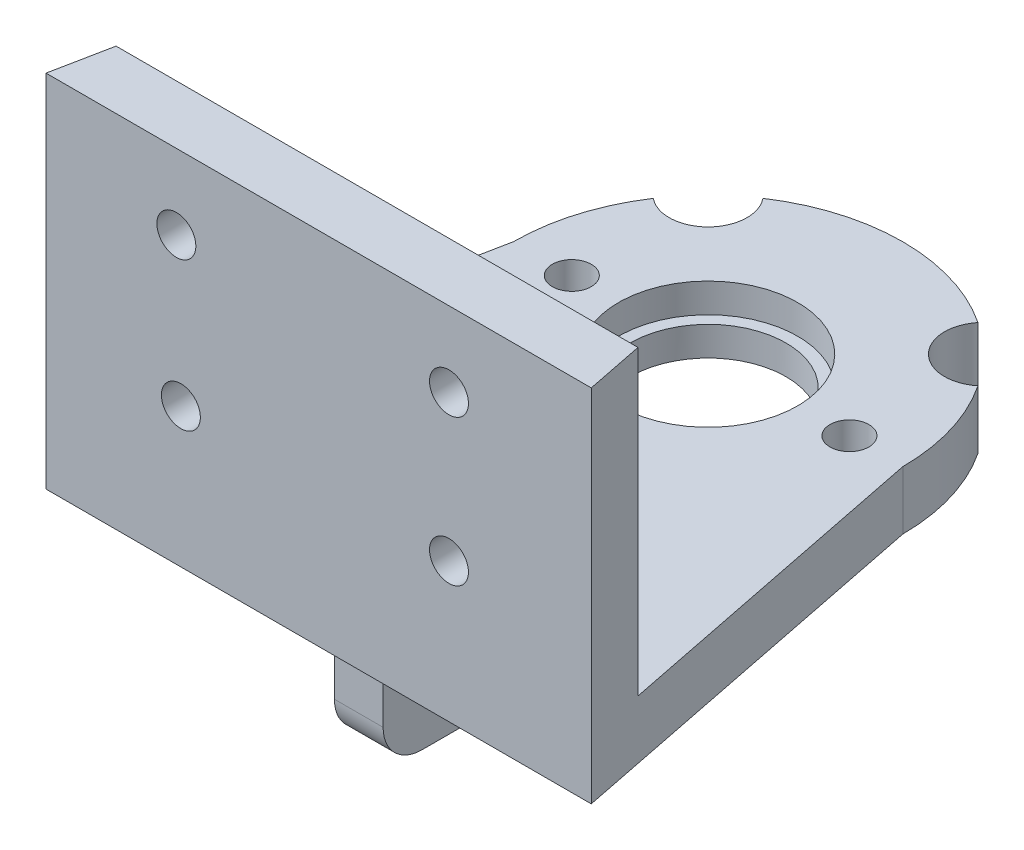
ISO-10303-21;
HEADER;
FILE_DESCRIPTION(('STEP AP214'),'2;1');
FILE_NAME('part.step','',(''),(''),'','','');
FILE_SCHEMA(('AUTOMOTIVE_DESIGN { 1 0 10303 214 1 1 1 1 }'));
ENDSEC;
DATA;
#1=APPLICATION_CONTEXT('core data for automotive mechanical design processes');
#2=APPLICATION_PROTOCOL_DEFINITION('international standard','automotive_design',2000,#1);
#3=PRODUCT_CONTEXT('',#1,'mechanical');
#4=PRODUCT('Part','Part','',(#3));
#5=PRODUCT_RELATED_PRODUCT_CATEGORY('part','',(#4));
#6=PRODUCT_DEFINITION_FORMATION('','',#4);
#7=PRODUCT_DEFINITION_CONTEXT('part definition',#1,'design');
#8=PRODUCT_DEFINITION('design','',#6,#7);
#9=PRODUCT_DEFINITION_SHAPE('','',#8);
#10=(LENGTH_UNIT() NAMED_UNIT(*) SI_UNIT(.MILLI.,.METRE.));
#11=(NAMED_UNIT(*) PLANE_ANGLE_UNIT() SI_UNIT($,.RADIAN.));
#12=(NAMED_UNIT(*) SI_UNIT($,.STERADIAN.) SOLID_ANGLE_UNIT());
#13=UNCERTAINTY_MEASURE_WITH_UNIT(LENGTH_MEASURE(1.E-05),#10,'distance_accuracy_value','');
#14=(GEOMETRIC_REPRESENTATION_CONTEXT(3) GLOBAL_UNCERTAINTY_ASSIGNED_CONTEXT((#13)) GLOBAL_UNIT_ASSIGNED_CONTEXT((#10,
#11,#12)) REPRESENTATION_CONTEXT('',''));
#15=CARTESIAN_POINT('',(0.,0.,0.));
#16=DIRECTION('',(0.,0.,1.));
#17=DIRECTION('',(1.,0.,0.));
#18=AXIS2_PLACEMENT_3D('',#15,#16,#17);
#19=CARTESIAN_POINT('',(0.,0.,0.));
#20=DIRECTION('',(0.,-1.,0.));
#21=DIRECTION('',(0.,0.,-1.));
#22=AXIS2_PLACEMENT_3D('',#19,#20,#21);
#23=PLANE('',#22);
#24=CARTESIAN_POINT('',(7.25622478910171,0.,0.));
#25=DIRECTION('',(0.,1.,0.));
#26=DIRECTION('',(0.,0.,1.));
#27=AXIS2_PLACEMENT_3D('',#24,#25,#26);
#28=CIRCLE('',#27,1.);
#29=CARTESIAN_POINT('',(7.25622478910171,0.,1.));
#30=VERTEX_POINT('',#29);
#31=EDGE_CURVE('E299',#30,#30,#28,.T.);
#32=ORIENTED_EDGE('',*,*,#31,.T.);
#33=EDGE_LOOP('',(#32));
#34=FACE_BOUND('',#33,.T.);
#35=CARTESIAN_POINT('',(0.,0.,7.59794095686522));
#36=DIRECTION('',(0.,1.,0.));
#37=DIRECTION('',(0.,0.,1.));
#38=AXIS2_PLACEMENT_3D('',#35,#36,#37);
#39=CIRCLE('',#38,1.);
#40=CARTESIAN_POINT('',(0.,0.,8.59794095686522));
#41=VERTEX_POINT('',#40);
#42=EDGE_CURVE('E305',#41,#41,#39,.T.);
#43=ORIENTED_EDGE('',*,*,#42,.T.);
#44=EDGE_LOOP('',(#43));
#45=FACE_BOUND('',#44,.T.);
#46=CARTESIAN_POINT('',(-7.,0.,0.));
#47=DIRECTION('',(0.,1.,0.));
#48=DIRECTION('',(0.,0.,1.));
#49=AXIS2_PLACEMENT_3D('',#46,#47,#48);
#50=CIRCLE('',#49,1.);
#51=CARTESIAN_POINT('',(-7.,0.,0.999999999999975));
#52=VERTEX_POINT('',#51);
#53=EDGE_CURVE('E311',#52,#52,#50,.T.);
#54=ORIENTED_EDGE('',*,*,#53,.T.);
#55=EDGE_LOOP('',(#54));
#56=FACE_BOUND('',#55,.T.);
#57=CARTESIAN_POINT('',(7.07106781186546,0.,-7.07106781186549));
#58=DIRECTION('',(0.,-1.,0.));
#59=DIRECTION('',(0.,0.,-1.));
#60=AXIS2_PLACEMENT_3D('',#57,#58,#59);
#61=CIRCLE('',#60,2.);
#62=CARTESIAN_POINT('',(8.33677118357518,0.,-5.52252172768116));
#63=VERTEX_POINT('',#62);
#64=CARTESIAN_POINT('',(5.52252172768113,0.,-8.3367711835752));
#65=VERTEX_POINT('',#64);
#66=EDGE_CURVE('E169',#63,#65,#61,.T.);
#67=ORIENTED_EDGE('',*,*,#66,.F.);
#68=CARTESIAN_POINT('',(0.,0.,0.));
#69=DIRECTION('',(0.,1.,0.));
#70=DIRECTION('',(0.,0.,-1.));
#71=AXIS2_PLACEMENT_3D('',#68,#69,#70);
#72=CIRCLE('',#71,10.);
#73=CARTESIAN_POINT('',(10.,0.,0.));
#74=VERTEX_POINT('',#73);
#75=EDGE_CURVE('E399',#74,#63,#72,.T.);
#76=ORIENTED_EDGE('',*,*,#75,.F.);
#77=DIRECTION('',(-0.196116135138184,0.,-0.98058067569092));
#78=VECTOR('',#77,1.);
#79=CARTESIAN_POINT('',(10.,0.,0.));
#80=LINE('',#79,#78);
#81=CARTESIAN_POINT('',(14.,0.,20.));
#82=VERTEX_POINT('',#81);
#83=EDGE_CURVE('E192',#82,#74,#80,.T.);
#84=ORIENTED_EDGE('',*,*,#83,.F.);
#85=DIRECTION('',(1.,0.,0.));
#86=VECTOR('',#85,1.);
#87=CARTESIAN_POINT('',(-14.,0.,20.));
#88=LINE('',#87,#86);
#89=CARTESIAN_POINT('',(-14.,0.,20.));
#90=VERTEX_POINT('',#89);
#91=EDGE_CURVE('E397',#90,#82,#88,.T.);
#92=ORIENTED_EDGE('',*,*,#91,.F.);
#93=DIRECTION('',(-0.196116135138184,0.,0.98058067569092));
#94=VECTOR('',#93,1.);
#95=CARTESIAN_POINT('',(-10.,0.,0.));
#96=LINE('',#95,#94);
#97=CARTESIAN_POINT('',(-10.,0.,0.));
#98=VERTEX_POINT('',#97);
#99=EDGE_CURVE('E374',#98,#90,#96,.T.);
#100=ORIENTED_EDGE('',*,*,#99,.F.);
#101=CARTESIAN_POINT('',(-8.33677118357518,0.,-5.52252172768116));
#102=VERTEX_POINT('',#101);
#103=EDGE_CURVE('E392',#102,#98,#72,.T.);
#104=ORIENTED_EDGE('',*,*,#103,.F.);
#105=CARTESIAN_POINT('',(-7.07106781186546,0.,-7.07106781186549));
#106=DIRECTION('',(0.,-1.,0.));
#107=DIRECTION('',(0.,0.,-1.));
#108=AXIS2_PLACEMENT_3D('',#105,#106,#107);
#109=CIRCLE('',#108,2.);
#110=CARTESIAN_POINT('',(-5.52252172768113,0.,-8.3367711835752));
#111=VERTEX_POINT('',#110);
#112=EDGE_CURVE('E228',#111,#102,#109,.T.);
#113=ORIENTED_EDGE('',*,*,#112,.F.);
#114=EDGE_CURVE('E401',#65,#111,#72,.T.);
#115=ORIENTED_EDGE('',*,*,#114,.F.);
#116=EDGE_LOOP('',(#67,#76,#84,#92,#100,#104,#113,#115));
#117=FACE_BOUND('',#116,.T.);
#118=CARTESIAN_POINT('',(0.,0.,0.));
#119=DIRECTION('',(0.,-1.,0.));
#120=DIRECTION('',(0.,0.,-1.));
#121=AXIS2_PLACEMENT_3D('',#118,#119,#120);
#122=CIRCLE('',#121,4.);
#123=CARTESIAN_POINT('',(0.,0.,-4.));
#124=VERTEX_POINT('',#123);
#125=EDGE_CURVE('E205',#124,#124,#122,.T.);
#126=ORIENTED_EDGE('',*,*,#125,.F.);
#127=EDGE_LOOP('',(#126));
#128=FACE_BOUND('',#127,.T.);
#129=DIRECTION('',(0.,0.,1.));
#130=VECTOR('',#129,1.);
#131=CARTESIAN_POINT('',(-1.25,0.,10.9392819052399));
#132=LINE('',#131,#130);
#133=CARTESIAN_POINT('',(-1.25,0.,8.93928190523991));
#134=VERTEX_POINT('',#133);
#135=CARTESIAN_POINT('',(-1.25,0.,19.9392819052399));
#136=VERTEX_POINT('',#135);
#137=EDGE_CURVE('E266',#134,#136,#132,.T.);
#138=ORIENTED_EDGE('',*,*,#137,.T.);
#139=DIRECTION('',(-1.,0.,0.));
#140=VECTOR('',#139,1.);
#141=CARTESIAN_POINT('',(0.,0.,19.9392819052399));
#142=LINE('',#141,#140);
#143=CARTESIAN_POINT('',(1.25,0.,19.9392819052399));
#144=VERTEX_POINT('',#143);
#145=EDGE_CURVE('E240',#136,#144,#142,.F.);
#146=ORIENTED_EDGE('',*,*,#145,.T.);
#147=DIRECTION('',(0.,0.,1.));
#148=VECTOR('',#147,1.);
#149=CARTESIAN_POINT('',(1.25,0.,10.9392819052399));
#150=LINE('',#149,#148);
#151=CARTESIAN_POINT('',(1.25,0.,8.93928190523991));
#152=VERTEX_POINT('',#151);
#153=EDGE_CURVE('E283',#152,#144,#150,.T.);
#154=ORIENTED_EDGE('',*,*,#153,.F.);
#155=DIRECTION('',(-1.,0.,0.));
#156=VECTOR('',#155,1.);
#157=CARTESIAN_POINT('',(-1.25,0.,8.93928190523991));
#158=LINE('',#157,#156);
#159=EDGE_CURVE('E237',#152,#134,#158,.T.);
#160=ORIENTED_EDGE('',*,*,#159,.T.);
#161=EDGE_LOOP('',(#138,#146,#154,#160));
#162=FACE_BOUND('',#161,.T.);
#163=ADVANCED_FACE('F37',(#34,#45,#56,#117,#128,#162),#23,.T.);
#164=CARTESIAN_POINT('',(0.,3.,0.));
#165=DIRECTION('',(0.,-1.,0.));
#166=DIRECTION('',(0.,0.,-1.));
#167=AXIS2_PLACEMENT_3D('',#164,#165,#166);
#168=CYLINDRICAL_SURFACE('',#167,10.);
#169=ORIENTED_EDGE('',*,*,#75,.T.);
#170=DIRECTION('',(0.,1.,0.));
#171=VECTOR('',#170,1.);
#172=CARTESIAN_POINT('',(8.33677118357519,-2.,-5.52252172768115));
#173=LINE('',#172,#171);
#174=CARTESIAN_POINT('',(8.33677118357519,3.,-5.52252172768115));
#175=VERTEX_POINT('',#174);
#176=EDGE_CURVE('E173',#63,#175,#173,.T.);
#177=ORIENTED_EDGE('',*,*,#176,.T.);
#178=CARTESIAN_POINT('',(0.,3.,0.));
#179=DIRECTION('',(0.,1.,0.));
#180=DIRECTION('',(0.,0.,-1.));
#181=AXIS2_PLACEMENT_3D('',#178,#179,#180);
#182=CIRCLE('',#181,10.);
#183=CARTESIAN_POINT('',(10.,3.,0.));
#184=VERTEX_POINT('',#183);
#185=EDGE_CURVE('E182',#184,#175,#182,.T.);
#186=ORIENTED_EDGE('',*,*,#185,.F.);
#187=DIRECTION('',(0.,-1.,0.));
#188=VECTOR('',#187,1.);
#189=CARTESIAN_POINT('',(10.,3.,0.));
#190=LINE('',#189,#188);
#191=EDGE_CURVE('E208',#184,#74,#190,.T.);
#192=ORIENTED_EDGE('',*,*,#191,.T.);
#193=EDGE_LOOP('',(#169,#177,#186,#192));
#194=FACE_BOUND('',#193,.T.);
#195=ADVANCED_FACE('F412',(#194),#168,.T.);
#196=CARTESIAN_POINT('',(5.52252172768112,3.,-8.33677118357521));
#197=VERTEX_POINT('',#196);
#198=CARTESIAN_POINT('',(-5.52252172768112,3.,-8.33677118357521));
#199=VERTEX_POINT('',#198);
#200=EDGE_CURVE('E179',#197,#199,#182,.T.);
#201=ORIENTED_EDGE('',*,*,#200,.F.);
#202=DIRECTION('',(0.,1.,0.));
#203=VECTOR('',#202,1.);
#204=CARTESIAN_POINT('',(5.52252172768112,-2.,-8.33677118357521));
#205=LINE('',#204,#203);
#206=EDGE_CURVE('E163',#197,#65,#205,.F.);
#207=ORIENTED_EDGE('',*,*,#206,.T.);
#208=ORIENTED_EDGE('',*,*,#114,.T.);
#209=DIRECTION('',(0.,1.,0.));
#210=VECTOR('',#209,1.);
#211=CARTESIAN_POINT('',(-5.52252172768112,-2.,-8.33677118357521));
#212=LINE('',#211,#210);
#213=EDGE_CURVE('E188',#111,#199,#212,.T.);
#214=ORIENTED_EDGE('',*,*,#213,.T.);
#215=EDGE_LOOP('',(#201,#207,#208,#214));
#216=FACE_BOUND('',#215,.T.);
#217=ADVANCED_FACE('F186',(#216),#168,.T.);
#218=CARTESIAN_POINT('',(0.,-10.,0.));
#219=DIRECTION('',(0.,1.,0.));
#220=DIRECTION('',(0.,0.,1.));
#221=AXIS2_PLACEMENT_3D('',#218,#219,#220);
#222=CYLINDRICAL_SURFACE('',#221,4.);
#223=ORIENTED_EDGE('',*,*,#125,.T.);
#224=EDGE_LOOP('',(#223));
#225=FACE_BOUND('',#224,.T.);
#226=CARTESIAN_POINT('',(0.,1.5,0.));
#227=DIRECTION('',(0.,1.,0.));
#228=DIRECTION('',(0.,0.,1.));
#229=AXIS2_PLACEMENT_3D('',#226,#227,#228);
#230=CIRCLE('',#229,4.);
#231=CARTESIAN_POINT('',(0.,1.5,4.));
#232=VERTEX_POINT('',#231);
#233=EDGE_CURVE('E213',#232,#232,#230,.F.);
#234=ORIENTED_EDGE('',*,*,#233,.F.);
#235=EDGE_LOOP('',(#234));
#236=FACE_BOUND('',#235,.T.);
#237=ADVANCED_FACE('F407',(#225,#236),#222,.F.);
#238=CARTESIAN_POINT('',(0.,3.,0.));
#239=DIRECTION('',(0.,-1.,0.));
#240=DIRECTION('',(0.,0.,-1.));
#241=AXIS2_PLACEMENT_3D('',#238,#239,#240);
#242=PLANE('',#241);
#243=CARTESIAN_POINT('',(7.25622478910171,3.,0.));
#244=DIRECTION('',(0.,1.,0.));
#245=DIRECTION('',(0.,0.,1.));
#246=AXIS2_PLACEMENT_3D('',#243,#244,#245);
#247=CIRCLE('',#246,1.);
#248=CARTESIAN_POINT('',(7.25622478910171,3.,1.));
#249=VERTEX_POINT('',#248);
#250=EDGE_CURVE('E298',#249,#249,#247,.T.);
#251=ORIENTED_EDGE('',*,*,#250,.F.);
#252=EDGE_LOOP('',(#251));
#253=FACE_BOUND('',#252,.T.);
#254=CARTESIAN_POINT('',(0.,3.,7.59794095686522));
#255=DIRECTION('',(0.,1.,0.));
#256=DIRECTION('',(0.,0.,1.));
#257=AXIS2_PLACEMENT_3D('',#254,#255,#256);
#258=CIRCLE('',#257,1.);
#259=CARTESIAN_POINT('',(0.,3.,8.59794095686522));
#260=VERTEX_POINT('',#259);
#261=EDGE_CURVE('E302',#260,#260,#258,.T.);
#262=ORIENTED_EDGE('',*,*,#261,.F.);
#263=EDGE_LOOP('',(#262));
#264=FACE_BOUND('',#263,.T.);
#265=CARTESIAN_POINT('',(-7.,3.,0.));
#266=DIRECTION('',(0.,1.,0.));
#267=DIRECTION('',(0.,0.,1.));
#268=AXIS2_PLACEMENT_3D('',#265,#266,#267);
#269=CIRCLE('',#268,1.);
#270=CARTESIAN_POINT('',(-7.,3.,0.999999999999975));
#271=VERTEX_POINT('',#270);
#272=EDGE_CURVE('E308',#271,#271,#269,.T.);
#273=ORIENTED_EDGE('',*,*,#272,.F.);
#274=EDGE_LOOP('',(#273));
#275=FACE_BOUND('',#274,.T.);
#276=CARTESIAN_POINT('',(0.,3.,0.));
#277=DIRECTION('',(0.,1.,0.));
#278=DIRECTION('',(0.,0.,1.));
#279=AXIS2_PLACEMENT_3D('',#276,#277,#278);
#280=CIRCLE('',#279,4.6);
#281=CARTESIAN_POINT('',(0.,3.,4.6));
#282=VERTEX_POINT('',#281);
#283=EDGE_CURVE('E346',#282,#282,#280,.T.);
#284=ORIENTED_EDGE('',*,*,#283,.F.);
#285=EDGE_LOOP('',(#284));
#286=FACE_BOUND('',#285,.T.);
#287=ORIENTED_EDGE('',*,*,#185,.T.);
#288=CARTESIAN_POINT('',(7.07106781186546,3.,-7.07106781186549));
#289=DIRECTION('',(0.,1.,0.));
#290=DIRECTION('',(0.,0.,-1.));
#291=AXIS2_PLACEMENT_3D('',#288,#289,#290);
#292=CIRCLE('',#291,2.);
#293=EDGE_CURVE('E166',#197,#175,#292,.T.);
#294=ORIENTED_EDGE('',*,*,#293,.F.);
#295=ORIENTED_EDGE('',*,*,#200,.T.);
#296=CARTESIAN_POINT('',(-7.07106781186546,3.,-7.07106781186549));
#297=DIRECTION('',(0.,1.,0.));
#298=DIRECTION('',(0.,0.,1.));
#299=AXIS2_PLACEMENT_3D('',#296,#297,#298);
#300=CIRCLE('',#299,2.);
#301=CARTESIAN_POINT('',(-8.33677118357519,3.,-5.52252172768115));
#302=VERTEX_POINT('',#301);
#303=EDGE_CURVE('E340',#302,#199,#300,.T.);
#304=ORIENTED_EDGE('',*,*,#303,.F.);
#305=CARTESIAN_POINT('',(-10.,3.,0.));
#306=VERTEX_POINT('',#305);
#307=EDGE_CURVE('E189',#302,#306,#182,.T.);
#308=ORIENTED_EDGE('',*,*,#307,.T.);
#309=DIRECTION('',(-0.196116135138184,0.,0.98058067569092));
#310=VECTOR('',#309,1.);
#311=CARTESIAN_POINT('',(-10.,3.,0.));
#312=LINE('',#311,#310);
#313=CARTESIAN_POINT('',(-13.4,3.,17.));
#314=VERTEX_POINT('',#313);
#315=EDGE_CURVE('E191',#306,#314,#312,.T.);
#316=ORIENTED_EDGE('',*,*,#315,.T.);
#317=DIRECTION('',(-1.,0.,0.));
#318=VECTOR('',#317,1.);
#319=CARTESIAN_POINT('',(-13.4,3.,17.));
#320=LINE('',#319,#318);
#321=CARTESIAN_POINT('',(13.4,3.,17.));
#322=VERTEX_POINT('',#321);
#323=EDGE_CURVE('E209',#322,#314,#320,.T.);
#324=ORIENTED_EDGE('',*,*,#323,.F.);
#325=DIRECTION('',(-0.196116135138184,0.,-0.98058067569092));
#326=VECTOR('',#325,1.);
#327=CARTESIAN_POINT('',(10.,3.,0.));
#328=LINE('',#327,#326);
#329=EDGE_CURVE('E204',#322,#184,#328,.T.);
#330=ORIENTED_EDGE('',*,*,#329,.T.);
#331=EDGE_LOOP('',(#287,#294,#295,#304,#308,#316,#324,#330));
#332=FACE_BOUND('',#331,.T.);
#333=ADVANCED_FACE('F177',(#253,#264,#275,#286,#332),#242,.F.);
#334=ORIENTED_EDGE('',*,*,#307,.F.);
#335=DIRECTION('',(0.,1.,0.));
#336=VECTOR('',#335,1.);
#337=CARTESIAN_POINT('',(-8.33677118357519,-2.,-5.52252172768115));
#338=LINE('',#337,#336);
#339=EDGE_CURVE('E342',#302,#102,#338,.F.);
#340=ORIENTED_EDGE('',*,*,#339,.T.);
#341=ORIENTED_EDGE('',*,*,#103,.T.);
#342=DIRECTION('',(0.,-1.,0.));
#343=VECTOR('',#342,1.);
#344=CARTESIAN_POINT('',(-10.,3.,0.));
#345=LINE('',#344,#343);
#346=EDGE_CURVE('E230',#306,#98,#345,.T.);
#347=ORIENTED_EDGE('',*,*,#346,.F.);
#348=EDGE_LOOP('',(#334,#340,#341,#347));
#349=FACE_BOUND('',#348,.T.);
#350=ADVANCED_FACE('F390',(#349),#168,.T.);
#351=CARTESIAN_POINT('',(-10.,3.,0.));
#352=DIRECTION('',(0.98058067569092,0.,0.196116135138184));
#353=DIRECTION('',(0.196116135138184,0.,-0.98058067569092));
#354=AXIS2_PLACEMENT_3D('',#351,#352,#353);
#355=PLANE('',#354);
#356=ORIENTED_EDGE('',*,*,#99,.T.);
#357=DIRECTION('',(0.,-1.,0.));
#358=VECTOR('',#357,1.);
#359=CARTESIAN_POINT('',(-14.,3.,20.));
#360=LINE('',#359,#358);
#361=CARTESIAN_POINT('',(-14.,18.5,20.));
#362=VERTEX_POINT('',#361);
#363=EDGE_CURVE('E370',#362,#90,#360,.T.);
#364=ORIENTED_EDGE('',*,*,#363,.F.);
#365=DIRECTION('',(-0.196116135138184,0.,0.98058067569092));
#366=VECTOR('',#365,1.);
#367=CARTESIAN_POINT('',(-13.4,18.5,17.));
#368=LINE('',#367,#366);
#369=CARTESIAN_POINT('',(-13.4,18.5,17.));
#370=VERTEX_POINT('',#369);
#371=EDGE_CURVE('E212',#370,#362,#368,.T.);
#372=ORIENTED_EDGE('',*,*,#371,.F.);
#373=DIRECTION('',(0.,-1.,0.));
#374=VECTOR('',#373,1.);
#375=CARTESIAN_POINT('',(-13.4,18.5,17.));
#376=LINE('',#375,#374);
#377=EDGE_CURVE('E214',#370,#314,#376,.T.);
#378=ORIENTED_EDGE('',*,*,#377,.T.);
#379=ORIENTED_EDGE('',*,*,#315,.F.);
#380=ORIENTED_EDGE('',*,*,#346,.T.);
#381=EDGE_LOOP('',(#356,#364,#372,#378,#379,#380));
#382=FACE_BOUND('',#381,.T.);
#383=ADVANCED_FACE('F368',(#382),#355,.F.);
#384=CARTESIAN_POINT('',(-14.,3.,20.));
#385=DIRECTION('',(0.,0.,-1.));
#386=DIRECTION('',(-1.,0.,0.));
#387=AXIS2_PLACEMENT_3D('',#384,#385,#386);
#388=PLANE('',#387);
#389=CARTESIAN_POINT('',(-7.07366894934284,7.15183711810639,20.));
#390=DIRECTION('',(0.,0.,-1.));
#391=DIRECTION('',(-1.,0.,0.));
#392=AXIS2_PLACEMENT_3D('',#389,#390,#391);
#393=CIRCLE('',#392,1.);
#394=CARTESIAN_POINT('',(-8.07366894934284,7.15183711810639,20.));
#395=VERTEX_POINT('',#394);
#396=EDGE_CURVE('E319',#395,#395,#393,.T.);
#397=ORIENTED_EDGE('',*,*,#396,.T.);
#398=EDGE_LOOP('',(#397));
#399=FACE_BOUND('',#398,.T.);
#400=CARTESIAN_POINT('',(-7.30606136960896,14.6518371181064,20.));
#401=DIRECTION('',(0.,0.,-1.));
#402=DIRECTION('',(-1.,0.,0.));
#403=AXIS2_PLACEMENT_3D('',#400,#401,#402);
#404=CIRCLE('',#403,1.);
#405=CARTESIAN_POINT('',(-8.30606136960896,14.6518371181064,20.));
#406=VERTEX_POINT('',#405);
#407=EDGE_CURVE('E325',#406,#406,#404,.T.);
#408=ORIENTED_EDGE('',*,*,#407,.T.);
#409=EDGE_LOOP('',(#408));
#410=FACE_BOUND('',#409,.T.);
#411=CARTESIAN_POINT('',(6.69393863039105,14.6518371181064,20.));
#412=DIRECTION('',(0.,0.,-1.));
#413=DIRECTION('',(-1.,0.,0.));
#414=AXIS2_PLACEMENT_3D('',#411,#412,#413);
#415=CIRCLE('',#414,1.00000000000001);
#416=CARTESIAN_POINT('',(5.69393863039104,14.6518371181064,20.));
#417=VERTEX_POINT('',#416);
#418=EDGE_CURVE('E331',#417,#417,#415,.T.);
#419=ORIENTED_EDGE('',*,*,#418,.T.);
#420=EDGE_LOOP('',(#419));
#421=FACE_BOUND('',#420,.T.);
#422=CARTESIAN_POINT('',(6.69393863039105,7.1518371181064,20.));
#423=DIRECTION('',(0.,0.,-1.));
#424=DIRECTION('',(-1.,0.,0.));
#425=AXIS2_PLACEMENT_3D('',#422,#423,#424);
#426=CIRCLE('',#425,1.00000000000001);
#427=CARTESIAN_POINT('',(5.69393863039104,7.1518371181064,20.));
#428=VERTEX_POINT('',#427);
#429=EDGE_CURVE('E183',#428,#428,#426,.T.);
#430=ORIENTED_EDGE('',*,*,#429,.T.);
#431=EDGE_LOOP('',(#430));
#432=FACE_BOUND('',#431,.T.);
#433=ORIENTED_EDGE('',*,*,#91,.T.);
#434=DIRECTION('',(0.,-1.,0.));
#435=VECTOR('',#434,1.);
#436=CARTESIAN_POINT('',(14.,3.,20.));
#437=LINE('',#436,#435);
#438=CARTESIAN_POINT('',(14.,18.5,20.));
#439=VERTEX_POINT('',#438);
#440=EDGE_CURVE('E377',#439,#82,#437,.T.);
#441=ORIENTED_EDGE('',*,*,#440,.F.);
#442=DIRECTION('',(1.,0.,0.));
#443=VECTOR('',#442,1.);
#444=CARTESIAN_POINT('',(-14.,18.5,20.));
#445=LINE('',#444,#443);
#446=EDGE_CURVE('E353',#362,#439,#445,.T.);
#447=ORIENTED_EDGE('',*,*,#446,.F.);
#448=ORIENTED_EDGE('',*,*,#363,.T.);
#449=EDGE_LOOP('',(#433,#441,#447,#448));
#450=FACE_BOUND('',#449,.T.);
#451=ADVANCED_FACE('F379',(#399,#410,#421,#432,#450),#388,.F.);
#452=CARTESIAN_POINT('',(10.,3.,0.));
#453=DIRECTION('',(-0.98058067569092,0.,0.196116135138184));
#454=DIRECTION('',(0.196116135138184,0.,0.98058067569092));
#455=AXIS2_PLACEMENT_3D('',#452,#453,#454);
#456=PLANE('',#455);
#457=ORIENTED_EDGE('',*,*,#83,.T.);
#458=ORIENTED_EDGE('',*,*,#191,.F.);
#459=ORIENTED_EDGE('',*,*,#329,.F.);
#460=DIRECTION('',(0.,-1.,0.));
#461=VECTOR('',#460,1.);
#462=CARTESIAN_POINT('',(13.4,18.5,17.));
#463=LINE('',#462,#461);
#464=CARTESIAN_POINT('',(13.4,18.5,17.));
#465=VERTEX_POINT('',#464);
#466=EDGE_CURVE('E217',#465,#322,#463,.T.);
#467=ORIENTED_EDGE('',*,*,#466,.F.);
#468=DIRECTION('',(-0.196116135138184,0.,-0.98058067569092));
#469=VECTOR('',#468,1.);
#470=CARTESIAN_POINT('',(14.,18.5,20.));
#471=LINE('',#470,#469);
#472=EDGE_CURVE('E356',#439,#465,#471,.T.);
#473=ORIENTED_EDGE('',*,*,#472,.F.);
#474=ORIENTED_EDGE('',*,*,#440,.T.);
#475=EDGE_LOOP('',(#457,#458,#459,#467,#473,#474));
#476=FACE_BOUND('',#475,.T.);
#477=ADVANCED_FACE('F382',(#476),#456,.F.);
#478=CARTESIAN_POINT('',(-13.4,18.5,17.));
#479=DIRECTION('',(0.,0.,1.));
#480=DIRECTION('',(1.,0.,0.));
#481=AXIS2_PLACEMENT_3D('',#478,#479,#480);
#482=PLANE('',#481);
#483=CARTESIAN_POINT('',(-7.07366894934284,7.15183711810639,17.));
#484=DIRECTION('',(0.,0.,-1.));
#485=DIRECTION('',(-1.,0.,0.));
#486=AXIS2_PLACEMENT_3D('',#483,#484,#485);
#487=CIRCLE('',#486,1.);
#488=CARTESIAN_POINT('',(-8.07366894934284,7.15183711810639,17.));
#489=VERTEX_POINT('',#488);
#490=EDGE_CURVE('E314',#489,#489,#487,.T.);
#491=ORIENTED_EDGE('',*,*,#490,.F.);
#492=EDGE_LOOP('',(#491));
#493=FACE_BOUND('',#492,.T.);
#494=CARTESIAN_POINT('',(-7.30606136960896,14.6518371181064,17.));
#495=DIRECTION('',(0.,0.,-1.));
#496=DIRECTION('',(-1.,0.,0.));
#497=AXIS2_PLACEMENT_3D('',#494,#495,#496);
#498=CIRCLE('',#497,1.);
#499=CARTESIAN_POINT('',(-8.30606136960896,14.6518371181064,17.));
#500=VERTEX_POINT('',#499);
#501=EDGE_CURVE('E322',#500,#500,#498,.T.);
#502=ORIENTED_EDGE('',*,*,#501,.F.);
#503=EDGE_LOOP('',(#502));
#504=FACE_BOUND('',#503,.T.);
#505=CARTESIAN_POINT('',(6.69393863039105,14.6518371181064,17.));
#506=DIRECTION('',(0.,0.,-1.));
#507=DIRECTION('',(-1.,0.,0.));
#508=AXIS2_PLACEMENT_3D('',#505,#506,#507);
#509=CIRCLE('',#508,1.00000000000001);
#510=CARTESIAN_POINT('',(5.69393863039104,14.6518371181064,17.));
#511=VERTEX_POINT('',#510);
#512=EDGE_CURVE('E328',#511,#511,#509,.T.);
#513=ORIENTED_EDGE('',*,*,#512,.F.);
#514=EDGE_LOOP('',(#513));
#515=FACE_BOUND('',#514,.T.);
#516=CARTESIAN_POINT('',(6.69393863039105,7.1518371181064,17.));
#517=DIRECTION('',(0.,0.,-1.));
#518=DIRECTION('',(-1.,0.,0.));
#519=AXIS2_PLACEMENT_3D('',#516,#517,#518);
#520=CIRCLE('',#519,1.00000000000001);
#521=CARTESIAN_POINT('',(5.69393863039104,7.1518371181064,17.));
#522=VERTEX_POINT('',#521);
#523=EDGE_CURVE('E334',#522,#522,#520,.T.);
#524=ORIENTED_EDGE('',*,*,#523,.F.);
#525=EDGE_LOOP('',(#524));
#526=FACE_BOUND('',#525,.T.);
#527=ORIENTED_EDGE('',*,*,#323,.T.);
#528=ORIENTED_EDGE('',*,*,#377,.F.);
#529=DIRECTION('',(-1.,0.,0.));
#530=VECTOR('',#529,1.);
#531=CARTESIAN_POINT('',(-13.4,18.5,17.));
#532=LINE('',#531,#530);
#533=EDGE_CURVE('E218',#465,#370,#532,.T.);
#534=ORIENTED_EDGE('',*,*,#533,.F.);
#535=ORIENTED_EDGE('',*,*,#466,.T.);
#536=EDGE_LOOP('',(#527,#528,#534,#535));
#537=FACE_BOUND('',#536,.T.);
#538=ADVANCED_FACE('F365',(#493,#504,#515,#526,#537),#482,.F.);
#539=CARTESIAN_POINT('',(0.,18.5,0.));
#540=DIRECTION('',(0.,1.,0.));
#541=DIRECTION('',(0.,0.,1.));
#542=AXIS2_PLACEMENT_3D('',#539,#540,#541);
#543=PLANE('',#542);
#544=ORIENTED_EDGE('',*,*,#371,.T.);
#545=ORIENTED_EDGE('',*,*,#446,.T.);
#546=ORIENTED_EDGE('',*,*,#472,.T.);
#547=ORIENTED_EDGE('',*,*,#533,.T.);
#548=EDGE_LOOP('',(#544,#545,#546,#547));
#549=FACE_BOUND('',#548,.T.);
#550=ADVANCED_FACE('F360',(#549),#543,.T.);
#551=CARTESIAN_POINT('',(0.,1.5,0.));
#552=DIRECTION('',(0.,1.,0.));
#553=DIRECTION('',(0.,0.,1.));
#554=AXIS2_PLACEMENT_3D('',#551,#552,#553);
#555=PLANE('',#554);
#556=CARTESIAN_POINT('',(0.,1.5,0.));
#557=DIRECTION('',(0.,1.,0.));
#558=DIRECTION('',(0.,0.,1.));
#559=AXIS2_PLACEMENT_3D('',#556,#557,#558);
#560=CIRCLE('',#559,4.6);
#561=CARTESIAN_POINT('',(0.,1.5,4.6));
#562=VERTEX_POINT('',#561);
#563=EDGE_CURVE('E227',#562,#562,#560,.T.);
#564=ORIENTED_EDGE('',*,*,#563,.T.);
#565=EDGE_LOOP('',(#564));
#566=FACE_BOUND('',#565,.T.);
#567=ORIENTED_EDGE('',*,*,#233,.T.);
#568=EDGE_LOOP('',(#567));
#569=FACE_BOUND('',#568,.T.);
#570=ADVANCED_FACE('F490',(#566,#569),#555,.T.);
#571=CARTESIAN_POINT('',(0.,1.5,0.));
#572=DIRECTION('',(0.,1.,0.));
#573=DIRECTION('',(0.,0.,1.));
#574=AXIS2_PLACEMENT_3D('',#571,#572,#573);
#575=CYLINDRICAL_SURFACE('',#574,4.6);
#576=ORIENTED_EDGE('',*,*,#563,.F.);
#577=EDGE_LOOP('',(#576));
#578=FACE_BOUND('',#577,.T.);
#579=ORIENTED_EDGE('',*,*,#283,.T.);
#580=EDGE_LOOP('',(#579));
#581=FACE_BOUND('',#580,.T.);
#582=ADVANCED_FACE('F488',(#578,#581),#575,.F.);
#583=CARTESIAN_POINT('',(-7.07106781186546,-7.,-7.07106781186549));
#584=DIRECTION('',(0.,1.,0.));
#585=DIRECTION('',(0.,0.,1.));
#586=AXIS2_PLACEMENT_3D('',#583,#584,#585);
#587=CYLINDRICAL_SURFACE('',#586,2.);
#588=ORIENTED_EDGE('',*,*,#112,.T.);
#589=ORIENTED_EDGE('',*,*,#339,.F.);
#590=ORIENTED_EDGE('',*,*,#303,.T.);
#591=ORIENTED_EDGE('',*,*,#213,.F.);
#592=EDGE_LOOP('',(#588,#589,#590,#591));
#593=FACE_BOUND('',#592,.T.);
#594=ADVANCED_FACE('F485',(#593),#587,.F.);
#595=CARTESIAN_POINT('',(7.07106781186546,-7.,-7.07106781186549));
#596=DIRECTION('',(0.,1.,0.));
#597=DIRECTION('',(0.,0.,1.));
#598=AXIS2_PLACEMENT_3D('',#595,#596,#597);
#599=CYLINDRICAL_SURFACE('',#598,2.);
#600=ORIENTED_EDGE('',*,*,#66,.T.);
#601=ORIENTED_EDGE('',*,*,#206,.F.);
#602=ORIENTED_EDGE('',*,*,#293,.T.);
#603=ORIENTED_EDGE('',*,*,#176,.F.);
#604=EDGE_LOOP('',(#600,#601,#602,#603));
#605=FACE_BOUND('',#604,.T.);
#606=ADVANCED_FACE('F165',(#605),#599,.F.);
#607=CARTESIAN_POINT('',(6.69393863039105,7.1518371181064,27.));
#608=DIRECTION('',(0.,0.,-1.));
#609=DIRECTION('',(-1.,0.,0.));
#610=AXIS2_PLACEMENT_3D('',#607,#608,#609);
#611=CYLINDRICAL_SURFACE('',#610,1.00000000000001);
#612=ORIENTED_EDGE('',*,*,#523,.T.);
#613=EDGE_LOOP('',(#612));
#614=FACE_BOUND('',#613,.T.);
#615=ORIENTED_EDGE('',*,*,#429,.F.);
#616=EDGE_LOOP('',(#615));
#617=FACE_BOUND('',#616,.T.);
#618=ADVANCED_FACE('F478',(#614,#617),#611,.F.);
#619=CARTESIAN_POINT('',(6.69393863039105,14.6518371181064,27.));
#620=DIRECTION('',(0.,0.,-1.));
#621=DIRECTION('',(-1.,0.,0.));
#622=AXIS2_PLACEMENT_3D('',#619,#620,#621);
#623=CYLINDRICAL_SURFACE('',#622,1.00000000000001);
#624=ORIENTED_EDGE('',*,*,#512,.T.);
#625=EDGE_LOOP('',(#624));
#626=FACE_BOUND('',#625,.T.);
#627=ORIENTED_EDGE('',*,*,#418,.F.);
#628=EDGE_LOOP('',(#627));
#629=FACE_BOUND('',#628,.T.);
#630=ADVANCED_FACE('F474',(#626,#629),#623,.F.);
#631=CARTESIAN_POINT('',(-7.30606136960896,14.6518371181064,27.));
#632=DIRECTION('',(0.,0.,-1.));
#633=DIRECTION('',(-1.,0.,0.));
#634=AXIS2_PLACEMENT_3D('',#631,#632,#633);
#635=CYLINDRICAL_SURFACE('',#634,1.);
#636=ORIENTED_EDGE('',*,*,#501,.T.);
#637=EDGE_LOOP('',(#636));
#638=FACE_BOUND('',#637,.T.);
#639=ORIENTED_EDGE('',*,*,#407,.F.);
#640=EDGE_LOOP('',(#639));
#641=FACE_BOUND('',#640,.T.);
#642=ADVANCED_FACE('F470',(#638,#641),#635,.F.);
#643=CARTESIAN_POINT('',(-7.07366894934284,7.15183711810639,27.));
#644=DIRECTION('',(0.,0.,-1.));
#645=DIRECTION('',(-1.,0.,0.));
#646=AXIS2_PLACEMENT_3D('',#643,#644,#645);
#647=CYLINDRICAL_SURFACE('',#646,1.);
#648=ORIENTED_EDGE('',*,*,#490,.T.);
#649=EDGE_LOOP('',(#648));
#650=FACE_BOUND('',#649,.T.);
#651=ORIENTED_EDGE('',*,*,#396,.F.);
#652=EDGE_LOOP('',(#651));
#653=FACE_BOUND('',#652,.T.);
#654=ADVANCED_FACE('F466',(#650,#653),#647,.F.);
#655=CARTESIAN_POINT('',(-7.,0.,0.));
#656=DIRECTION('',(0.,1.,0.));
#657=DIRECTION('',(0.,0.,1.));
#658=AXIS2_PLACEMENT_3D('',#655,#656,#657);
#659=CYLINDRICAL_SURFACE('',#658,1.);
#660=ORIENTED_EDGE('',*,*,#53,.F.);
#661=EDGE_LOOP('',(#660));
#662=FACE_BOUND('',#661,.T.);
#663=ORIENTED_EDGE('',*,*,#272,.T.);
#664=EDGE_LOOP('',(#663));
#665=FACE_BOUND('',#664,.T.);
#666=ADVANCED_FACE('F462',(#662,#665),#659,.F.);
#667=CARTESIAN_POINT('',(0.,0.,7.59794095686522));
#668=DIRECTION('',(0.,1.,0.));
#669=DIRECTION('',(0.,0.,1.));
#670=AXIS2_PLACEMENT_3D('',#667,#668,#669);
#671=CYLINDRICAL_SURFACE('',#670,1.);
#672=ORIENTED_EDGE('',*,*,#42,.F.);
#673=EDGE_LOOP('',(#672));
#674=FACE_BOUND('',#673,.T.);
#675=ORIENTED_EDGE('',*,*,#261,.T.);
#676=EDGE_LOOP('',(#675));
#677=FACE_BOUND('',#676,.T.);
#678=ADVANCED_FACE('F458',(#674,#677),#671,.F.);
#679=CARTESIAN_POINT('',(7.25622478910171,0.,0.));
#680=DIRECTION('',(0.,1.,0.));
#681=DIRECTION('',(0.,0.,1.));
#682=AXIS2_PLACEMENT_3D('',#679,#680,#681);
#683=CYLINDRICAL_SURFACE('',#682,1.);
#684=ORIENTED_EDGE('',*,*,#31,.F.);
#685=EDGE_LOOP('',(#684));
#686=FACE_BOUND('',#685,.T.);
#687=ORIENTED_EDGE('',*,*,#250,.T.);
#688=EDGE_LOOP('',(#687));
#689=FACE_BOUND('',#688,.T.);
#690=ADVANCED_FACE('F455',(#686,#689),#683,.F.);
#691=CARTESIAN_POINT('',(1.25,-6.,10.9392819052399));
#692=DIRECTION('',(-1.,0.,0.));
#693=DIRECTION('',(0.,0.,1.));
#694=AXIS2_PLACEMENT_3D('',#691,#692,#693);
#695=PLANE('',#694);
#696=CARTESIAN_POINT('',(1.25,-3.,14.4094478966643));
#697=DIRECTION('',(-1.,0.,0.));
#698=DIRECTION('',(0.,0.,1.));
#699=AXIS2_PLACEMENT_3D('',#696,#697,#698);
#700=CIRCLE('',#699,1.);
#701=CARTESIAN_POINT('',(1.25,-3.,15.4094478966643));
#702=VERTEX_POINT('',#701);
#703=EDGE_CURVE('E431',#702,#702,#700,.T.);
#704=ORIENTED_EDGE('',*,*,#703,.T.);
#705=EDGE_LOOP('',(#704));
#706=FACE_BOUND('',#705,.T.);
#707=DIRECTION('',(0.,1.,0.));
#708=VECTOR('',#707,1.);
#709=CARTESIAN_POINT('',(1.25,-6.,17.9392819052399));
#710=LINE('',#709,#708);
#711=CARTESIAN_POINT('',(1.25,-4.,17.9392819052399));
#712=VERTEX_POINT('',#711);
#713=CARTESIAN_POINT('',(1.25,-2.,17.9392819052399));
#714=VERTEX_POINT('',#713);
#715=EDGE_CURVE('E295',#712,#714,#710,.T.);
#716=ORIENTED_EDGE('',*,*,#715,.F.);
#717=CARTESIAN_POINT('',(1.25,-4.,15.9392819052399));
#718=DIRECTION('',(-1.,0.,0.));
#719=DIRECTION('',(0.,0.,1.));
#720=AXIS2_PLACEMENT_3D('',#717,#718,#719);
#721=CIRCLE('',#720,2.);
#722=CARTESIAN_POINT('',(1.25,-6.,15.9392819052399));
#723=VERTEX_POINT('',#722);
#724=EDGE_CURVE('E256',#712,#723,#721,.F.);
#725=ORIENTED_EDGE('',*,*,#724,.T.);
#726=DIRECTION('',(0.,0.,1.));
#727=VECTOR('',#726,1.);
#728=CARTESIAN_POINT('',(1.25,-6.,10.9392819052399));
#729=LINE('',#728,#727);
#730=CARTESIAN_POINT('',(1.25,-6.,12.9392819052399));
#731=VERTEX_POINT('',#730);
#732=EDGE_CURVE('E288',#731,#723,#729,.T.);
#733=ORIENTED_EDGE('',*,*,#732,.F.);
#734=CARTESIAN_POINT('',(1.25,-4.,12.9392819052399));
#735=DIRECTION('',(-1.,0.,0.));
#736=DIRECTION('',(0.,0.,1.));
#737=AXIS2_PLACEMENT_3D('',#734,#735,#736);
#738=CIRCLE('',#737,2.);
#739=CARTESIAN_POINT('',(1.25,-4.,10.9392819052399));
#740=VERTEX_POINT('',#739);
#741=EDGE_CURVE('E254',#731,#740,#738,.F.);
#742=ORIENTED_EDGE('',*,*,#741,.T.);
#743=DIRECTION('',(0.,1.,0.));
#744=VECTOR('',#743,1.);
#745=CARTESIAN_POINT('',(1.25,-6.,10.9392819052399));
#746=LINE('',#745,#744);
#747=CARTESIAN_POINT('',(1.25,-2.,10.9392819052399));
#748=VERTEX_POINT('',#747);
#749=EDGE_CURVE('E276',#740,#748,#746,.T.);
#750=ORIENTED_EDGE('',*,*,#749,.T.);
#751=CARTESIAN_POINT('',(1.25,-2.,8.93928190523991));
#752=DIRECTION('',(-1.,0.,0.));
#753=DIRECTION('',(0.,0.,1.));
#754=AXIS2_PLACEMENT_3D('',#751,#752,#753);
#755=CIRCLE('',#754,2.);
#756=EDGE_CURVE('E11',#748,#152,#755,.T.);
#757=ORIENTED_EDGE('',*,*,#756,.T.);
#758=ORIENTED_EDGE('',*,*,#153,.T.);
#759=CARTESIAN_POINT('',(1.25,-2.,19.9392819052399));
#760=DIRECTION('',(-1.,0.,0.));
#761=DIRECTION('',(0.,0.,1.));
#762=AXIS2_PLACEMENT_3D('',#759,#760,#761);
#763=CIRCLE('',#762,2.);
#764=EDGE_CURVE('E261',#144,#714,#763,.T.);
#765=ORIENTED_EDGE('',*,*,#764,.T.);
#766=EDGE_LOOP('',(#716,#725,#733,#742,#750,#757,#758,#765));
#767=FACE_BOUND('',#766,.T.);
#768=ADVANCED_FACE('F282',(#706,#767),#695,.F.);
#769=CARTESIAN_POINT('',(1.25,-6.,17.9392819052399));
#770=DIRECTION('',(0.,0.,-1.));
#771=DIRECTION('',(-1.,0.,0.));
#772=AXIS2_PLACEMENT_3D('',#769,#770,#771);
#773=PLANE('',#772);
#774=ORIENTED_EDGE('',*,*,#715,.T.);
#775=DIRECTION('',(-1.,0.,0.));
#776=VECTOR('',#775,1.);
#777=CARTESIAN_POINT('',(1.25,-2.,17.9392819052399));
#778=LINE('',#777,#776);
#779=CARTESIAN_POINT('',(-1.25,-2.,17.9392819052399));
#780=VERTEX_POINT('',#779);
#781=EDGE_CURVE('E234',#714,#780,#778,.T.);
#782=ORIENTED_EDGE('',*,*,#781,.T.);
#783=DIRECTION('',(0.,1.,0.));
#784=VECTOR('',#783,1.);
#785=CARTESIAN_POINT('',(-1.25,-6.,17.9392819052399));
#786=LINE('',#785,#784);
#787=CARTESIAN_POINT('',(-1.25,-4.,17.9392819052399));
#788=VERTEX_POINT('',#787);
#789=EDGE_CURVE('E275',#788,#780,#786,.T.);
#790=ORIENTED_EDGE('',*,*,#789,.F.);
#791=DIRECTION('',(-1.,0.,0.));
#792=VECTOR('',#791,1.);
#793=CARTESIAN_POINT('',(1.25,-4.,17.9392819052399));
#794=LINE('',#793,#792);
#795=EDGE_CURVE('E232',#788,#712,#794,.F.);
#796=ORIENTED_EDGE('',*,*,#795,.T.);
#797=EDGE_LOOP('',(#774,#782,#790,#796));
#798=FACE_BOUND('',#797,.T.);
#799=ADVANCED_FACE('F423',(#798),#773,.F.);
#800=CARTESIAN_POINT('',(-1.25,-6.,10.9392819052399));
#801=DIRECTION('',(-1.,0.,0.));
#802=DIRECTION('',(0.,0.,1.));
#803=AXIS2_PLACEMENT_3D('',#800,#801,#802);
#804=PLANE('',#803);
#805=CARTESIAN_POINT('',(-1.25,-3.,14.4094478966643));
#806=DIRECTION('',(-1.,0.,0.));
#807=DIRECTION('',(0.,0.,1.));
#808=AXIS2_PLACEMENT_3D('',#805,#806,#807);
#809=CIRCLE('',#808,1.);
#810=CARTESIAN_POINT('',(-1.25,-3.,15.4094478966643));
#811=VERTEX_POINT('',#810);
#812=EDGE_CURVE('E434',#811,#811,#809,.T.);
#813=ORIENTED_EDGE('',*,*,#812,.F.);
#814=EDGE_LOOP('',(#813));
#815=FACE_BOUND('',#814,.T.);
#816=DIRECTION('',(0.,0.,1.));
#817=VECTOR('',#816,1.);
#818=CARTESIAN_POINT('',(-1.25,-6.,10.9392819052399));
#819=LINE('',#818,#817);
#820=CARTESIAN_POINT('',(-1.25,-6.,12.9392819052399));
#821=VERTEX_POINT('',#820);
#822=CARTESIAN_POINT('',(-1.25,-6.,15.9392819052399));
#823=VERTEX_POINT('',#822);
#824=EDGE_CURVE('E286',#821,#823,#819,.T.);
#825=ORIENTED_EDGE('',*,*,#824,.T.);
#826=CARTESIAN_POINT('',(-1.25,-4.,15.9392819052399));
#827=DIRECTION('',(-1.,0.,0.));
#828=DIRECTION('',(0.,0.,1.));
#829=AXIS2_PLACEMENT_3D('',#826,#827,#828);
#830=CIRCLE('',#829,2.);
#831=EDGE_CURVE('E52',#823,#788,#830,.T.);
#832=ORIENTED_EDGE('',*,*,#831,.T.);
#833=ORIENTED_EDGE('',*,*,#789,.T.);
#834=CARTESIAN_POINT('',(-1.25,-2.,19.9392819052399));
#835=DIRECTION('',(-1.,0.,0.));
#836=DIRECTION('',(0.,0.,1.));
#837=AXIS2_PLACEMENT_3D('',#834,#835,#836);
#838=CIRCLE('',#837,2.);
#839=EDGE_CURVE('E258',#780,#136,#838,.F.);
#840=ORIENTED_EDGE('',*,*,#839,.T.);
#841=ORIENTED_EDGE('',*,*,#137,.F.);
#842=CARTESIAN_POINT('',(-1.25,-2.,8.93928190523991));
#843=DIRECTION('',(-1.,0.,0.));
#844=DIRECTION('',(0.,0.,1.));
#845=AXIS2_PLACEMENT_3D('',#842,#843,#844);
#846=CIRCLE('',#845,2.);
#847=CARTESIAN_POINT('',(-1.25,-2.,10.9392819052399));
#848=VERTEX_POINT('',#847);
#849=EDGE_CURVE('E45',#134,#848,#846,.F.);
#850=ORIENTED_EDGE('',*,*,#849,.T.);
#851=DIRECTION('',(0.,1.,0.));
#852=VECTOR('',#851,1.);
#853=CARTESIAN_POINT('',(-1.25,-6.,10.9392819052399));
#854=LINE('',#853,#852);
#855=CARTESIAN_POINT('',(-1.25,-4.,10.9392819052399));
#856=VERTEX_POINT('',#855);
#857=EDGE_CURVE('E265',#856,#848,#854,.T.);
#858=ORIENTED_EDGE('',*,*,#857,.F.);
#859=CARTESIAN_POINT('',(-1.25,-4.,12.9392819052399));
#860=DIRECTION('',(-1.,0.,0.));
#861=DIRECTION('',(0.,0.,1.));
#862=AXIS2_PLACEMENT_3D('',#859,#860,#861);
#863=CIRCLE('',#862,2.);
#864=EDGE_CURVE('E60',#856,#821,#863,.T.);
#865=ORIENTED_EDGE('',*,*,#864,.T.);
#866=EDGE_LOOP('',(#825,#832,#833,#840,#841,#850,#858,#865));
#867=FACE_BOUND('',#866,.T.);
#868=ADVANCED_FACE('F264',(#815,#867),#804,.T.);
#869=CARTESIAN_POINT('',(1.25,-6.,10.9392819052399));
#870=DIRECTION('',(0.,0.,-1.));
#871=DIRECTION('',(-1.,0.,0.));
#872=AXIS2_PLACEMENT_3D('',#869,#870,#871);
#873=PLANE('',#872);
#874=ORIENTED_EDGE('',*,*,#857,.T.);
#875=DIRECTION('',(-1.,0.,0.));
#876=VECTOR('',#875,1.);
#877=CARTESIAN_POINT('',(1.25,-2.,10.9392819052399));
#878=LINE('',#877,#876);
#879=EDGE_CURVE('E246',#848,#748,#878,.F.);
#880=ORIENTED_EDGE('',*,*,#879,.T.);
#881=ORIENTED_EDGE('',*,*,#749,.F.);
#882=DIRECTION('',(-1.,0.,0.));
#883=VECTOR('',#882,1.);
#884=CARTESIAN_POINT('',(1.25,-4.,10.9392819052399));
#885=LINE('',#884,#883);
#886=EDGE_CURVE('E243',#740,#856,#885,.T.);
#887=ORIENTED_EDGE('',*,*,#886,.T.);
#888=EDGE_LOOP('',(#874,#880,#881,#887));
#889=FACE_BOUND('',#888,.T.);
#890=ADVANCED_FACE('F271',(#889),#873,.T.);
#891=CARTESIAN_POINT('',(0.,-6.,0.));
#892=DIRECTION('',(0.,-1.,0.));
#893=DIRECTION('',(0.,0.,-1.));
#894=AXIS2_PLACEMENT_3D('',#891,#892,#893);
#895=PLANE('',#894);
#896=ORIENTED_EDGE('',*,*,#732,.T.);
#897=DIRECTION('',(-1.,0.,0.));
#898=VECTOR('',#897,1.);
#899=CARTESIAN_POINT('',(-1.25,-6.,15.9392819052399));
#900=LINE('',#899,#898);
#901=EDGE_CURVE('E250',#723,#823,#900,.T.);
#902=ORIENTED_EDGE('',*,*,#901,.T.);
#903=ORIENTED_EDGE('',*,*,#824,.F.);
#904=DIRECTION('',(-1.,0.,0.));
#905=VECTOR('',#904,1.);
#906=CARTESIAN_POINT('',(0.,-6.,12.9392819052399));
#907=LINE('',#906,#905);
#908=EDGE_CURVE('E248',#821,#731,#907,.F.);
#909=ORIENTED_EDGE('',*,*,#908,.T.);
#910=EDGE_LOOP('',(#896,#902,#903,#909));
#911=FACE_BOUND('',#910,.T.);
#912=ADVANCED_FACE('F427',(#911),#895,.T.);
#913=CARTESIAN_POINT('',(4.75,-3.,14.4094478966643));
#914=DIRECTION('',(-1.,0.,0.));
#915=DIRECTION('',(0.,0.,1.));
#916=AXIS2_PLACEMENT_3D('',#913,#914,#915);
#917=CYLINDRICAL_SURFACE('',#916,1.);
#918=ORIENTED_EDGE('',*,*,#812,.T.);
#919=EDGE_LOOP('',(#918));
#920=FACE_BOUND('',#919,.T.);
#921=ORIENTED_EDGE('',*,*,#703,.F.);
#922=EDGE_LOOP('',(#921));
#923=FACE_BOUND('',#922,.T.);
#924=ADVANCED_FACE('F440',(#920,#923),#917,.F.);
#925=CARTESIAN_POINT('',(1.25,-2.,19.9392819052399));
#926=DIRECTION('',(-1.,0.,0.));
#927=DIRECTION('',(0.,0.,1.));
#928=AXIS2_PLACEMENT_3D('',#925,#926,#927);
#929=CYLINDRICAL_SURFACE('',#928,2.);
#930=ORIENTED_EDGE('',*,*,#764,.F.);
#931=ORIENTED_EDGE('',*,*,#145,.F.);
#932=ORIENTED_EDGE('',*,*,#839,.F.);
#933=ORIENTED_EDGE('',*,*,#781,.F.);
#934=EDGE_LOOP('',(#930,#931,#932,#933));
#935=FACE_BOUND('',#934,.T.);
#936=ADVANCED_FACE('F420',(#935),#929,.F.);
#937=CARTESIAN_POINT('',(0.,-2.,8.93928190523991));
#938=DIRECTION('',(1.,0.,0.));
#939=DIRECTION('',(0.,0.,-1.));
#940=AXIS2_PLACEMENT_3D('',#937,#938,#939);
#941=CYLINDRICAL_SURFACE('',#940,2.);
#942=ORIENTED_EDGE('',*,*,#756,.F.);
#943=ORIENTED_EDGE('',*,*,#879,.F.);
#944=ORIENTED_EDGE('',*,*,#849,.F.);
#945=ORIENTED_EDGE('',*,*,#159,.F.);
#946=EDGE_LOOP('',(#942,#943,#944,#945));
#947=FACE_BOUND('',#946,.T.);
#948=ADVANCED_FACE('F279',(#947),#941,.F.);
#949=CARTESIAN_POINT('',(0.,-4.,15.9392819052399));
#950=DIRECTION('',(1.,0.,0.));
#951=DIRECTION('',(0.,0.,-1.));
#952=AXIS2_PLACEMENT_3D('',#949,#950,#951);
#953=CYLINDRICAL_SURFACE('',#952,2.);
#954=ORIENTED_EDGE('',*,*,#724,.F.);
#955=ORIENTED_EDGE('',*,*,#795,.F.);
#956=ORIENTED_EDGE('',*,*,#831,.F.);
#957=ORIENTED_EDGE('',*,*,#901,.F.);
#958=EDGE_LOOP('',(#954,#955,#956,#957));
#959=FACE_BOUND('',#958,.T.);
#960=ADVANCED_FACE('F424',(#959),#953,.T.);
#961=CARTESIAN_POINT('',(1.25,-4.,12.9392819052399));
#962=DIRECTION('',(-1.,0.,0.));
#963=DIRECTION('',(0.,0.,1.));
#964=AXIS2_PLACEMENT_3D('',#961,#962,#963);
#965=CYLINDRICAL_SURFACE('',#964,2.);
#966=ORIENTED_EDGE('',*,*,#741,.F.);
#967=ORIENTED_EDGE('',*,*,#908,.F.);
#968=ORIENTED_EDGE('',*,*,#864,.F.);
#969=ORIENTED_EDGE('',*,*,#886,.F.);
#970=EDGE_LOOP('',(#966,#967,#968,#969));
#971=FACE_BOUND('',#970,.T.);
#972=ADVANCED_FACE('F39',(#971),#965,.T.);
#973=CLOSED_SHELL('',(#163,#195,#217,#237,#333,#350,#383,#451,#477,#538,#550,#570,#582,#594,
#606,#618,#630,#642,#654,#666,#678,#690,#768,#799,#868,#890,#912,#924,#936,#948,#960,#972));
#974=MANIFOLD_SOLID_BREP('B2',#973);
#975=ADVANCED_BREP_SHAPE_REPRESENTATION('',(#18,#974),#14);
#976=SHAPE_DEFINITION_REPRESENTATION(#9,#975);
ENDSEC;
END-ISO-10303-21;
